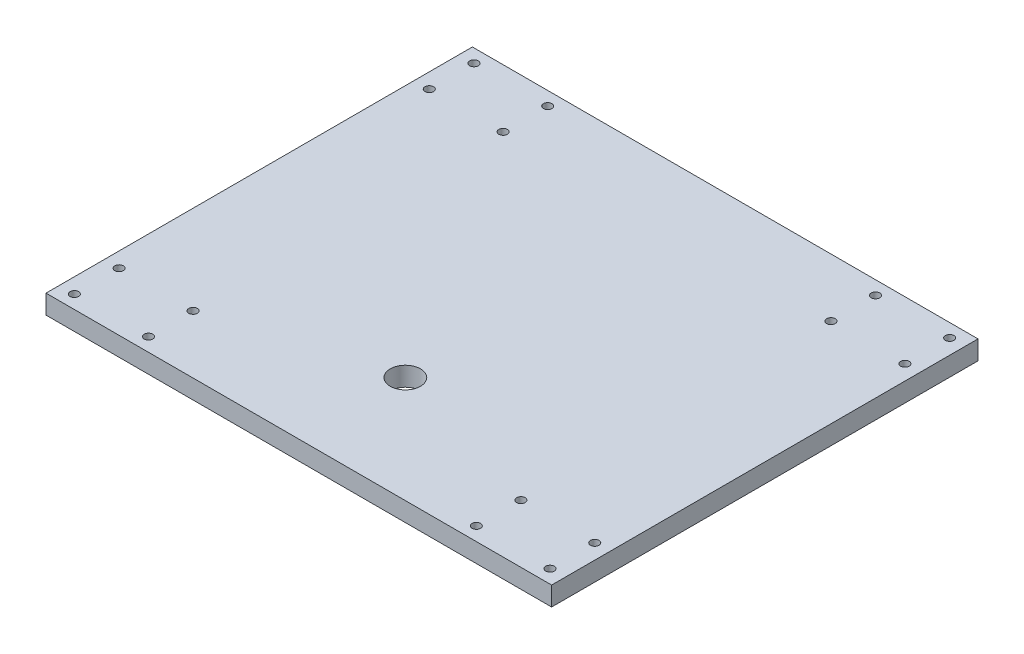
ISO-10303-21;
HEADER;
FILE_DESCRIPTION(('STEP AP214'),'2;1');
FILE_NAME('part.step','',(''),(''),'','','');
FILE_SCHEMA(('AUTOMOTIVE_DESIGN { 1 0 10303 214 1 1 1 1 }'));
ENDSEC;
DATA;
#1=APPLICATION_CONTEXT('core data for automotive mechanical design processes');
#2=APPLICATION_PROTOCOL_DEFINITION('international standard','automotive_design',2000,#1);
#3=PRODUCT_CONTEXT('',#1,'mechanical');
#4=PRODUCT('Part','Part','',(#3));
#5=PRODUCT_RELATED_PRODUCT_CATEGORY('part','',(#4));
#6=PRODUCT_DEFINITION_FORMATION('','',#4);
#7=PRODUCT_DEFINITION_CONTEXT('part definition',#1,'design');
#8=PRODUCT_DEFINITION('design','',#6,#7);
#9=PRODUCT_DEFINITION_SHAPE('','',#8);
#10=(LENGTH_UNIT() NAMED_UNIT(*) SI_UNIT(.MILLI.,.METRE.));
#11=(NAMED_UNIT(*) PLANE_ANGLE_UNIT() SI_UNIT($,.RADIAN.));
#12=(NAMED_UNIT(*) SI_UNIT($,.STERADIAN.) SOLID_ANGLE_UNIT());
#13=UNCERTAINTY_MEASURE_WITH_UNIT(LENGTH_MEASURE(1.E-05),#10,'distance_accuracy_value','');
#14=(GEOMETRIC_REPRESENTATION_CONTEXT(3) GLOBAL_UNCERTAINTY_ASSIGNED_CONTEXT((#13)) GLOBAL_UNIT_ASSIGNED_CONTEXT((#10,
#11,#12)) REPRESENTATION_CONTEXT('',''));
#15=CARTESIAN_POINT('',(0.,0.,0.));
#16=DIRECTION('',(0.,0.,1.));
#17=DIRECTION('',(1.,0.,0.));
#18=AXIS2_PLACEMENT_3D('',#15,#16,#17);
#19=CARTESIAN_POINT('',(0.,19.,0.));
#20=DIRECTION('',(0.,1.,0.));
#21=DIRECTION('',(0.,0.,1.));
#22=AXIS2_PLACEMENT_3D('',#19,#20,#21);
#23=PLANE('',#22);
#24=CARTESIAN_POINT('',(-88.5993514864296,19.,-411.467997078291));
#25=DIRECTION('',(0.,1.,0.));
#26=DIRECTION('',(0.,0.,-1.));
#27=AXIS2_PLACEMENT_3D('',#24,#25,#26);
#28=CIRCLE('',#27,4.25000000000001);
#29=CARTESIAN_POINT('',(-88.5993514864296,19.,-415.717997078291));
#30=VERTEX_POINT('',#29);
#31=EDGE_CURVE('E155',#30,#30,#28,.T.);
#32=ORIENTED_EDGE('',*,*,#31,.F.);
#33=EDGE_LOOP('',(#32));
#34=FACE_BOUND('',#33,.T.);
#35=CARTESIAN_POINT('',(-14.939385216055,19.,-367.08848854777));
#36=DIRECTION('',(0.,1.,0.));
#37=DIRECTION('',(0.,0.,-1.));
#38=AXIS2_PLACEMENT_3D('',#35,#36,#37);
#39=CIRCLE('',#38,4.25000000000001);
#40=CARTESIAN_POINT('',(-14.939385216055,19.,-371.33848854777));
#41=VERTEX_POINT('',#40);
#42=EDGE_CURVE('E148',#41,#41,#39,.T.);
#43=ORIENTED_EDGE('',*,*,#42,.F.);
#44=EDGE_LOOP('',(#43));
#45=FACE_BOUND('',#44,.T.);
#46=CARTESIAN_POINT('',(-88.5993514864296,19.,-367.017997078291));
#47=DIRECTION('',(0.,1.,0.));
#48=DIRECTION('',(0.,0.,-1.));
#49=AXIS2_PLACEMENT_3D('',#46,#47,#48);
#50=CIRCLE('',#49,4.25000000000001);
#51=CARTESIAN_POINT('',(-88.5993514864296,19.,-371.267997078291));
#52=VERTEX_POINT('',#51);
#53=EDGE_CURVE('E167',#52,#52,#50,.T.);
#54=ORIENTED_EDGE('',*,*,#53,.F.);
#55=EDGE_LOOP('',(#54));
#56=FACE_BOUND('',#55,.T.);
#57=CARTESIAN_POINT('',(-415.400648513571,19.,-367.017997078291));
#58=DIRECTION('',(0.,1.,0.));
#59=DIRECTION('',(0.,0.,1.));
#60=AXIS2_PLACEMENT_3D('',#57,#58,#59);
#61=CIRCLE('',#60,4.25000000000001);
#62=CARTESIAN_POINT('',(-415.400648513571,19.,-362.767997078291));
#63=VERTEX_POINT('',#62);
#64=EDGE_CURVE('E160',#63,#63,#61,.T.);
#65=ORIENTED_EDGE('',*,*,#64,.F.);
#66=EDGE_LOOP('',(#65));
#67=FACE_BOUND('',#66,.T.);
#68=CARTESIAN_POINT('',(-14.939385216055,19.,-57.9115114522298));
#69=DIRECTION('',(0.,1.,0.));
#70=DIRECTION('',(0.,0.,1.));
#71=AXIS2_PLACEMENT_3D('',#68,#69,#70);
#72=CIRCLE('',#71,4.25000000000001);
#73=CARTESIAN_POINT('',(-14.939385216055,19.,-53.6615114522297));
#74=VERTEX_POINT('',#73);
#75=EDGE_CURVE('E131',#74,#74,#72,.T.);
#76=ORIENTED_EDGE('',*,*,#75,.F.);
#77=EDGE_LOOP('',(#76));
#78=FACE_BOUND('',#77,.T.);
#79=CARTESIAN_POINT('',(-88.5993514864296,19.,-13.5320029217093));
#80=DIRECTION('',(0.,1.,0.));
#81=DIRECTION('',(0.,0.,1.));
#82=AXIS2_PLACEMENT_3D('',#79,#80,#81);
#83=CIRCLE('',#82,4.25000000000001);
#84=CARTESIAN_POINT('',(-88.5993514864296,19.,-9.28200292170929));
#85=VERTEX_POINT('',#84);
#86=EDGE_CURVE('E124',#85,#85,#83,.T.);
#87=ORIENTED_EDGE('',*,*,#86,.F.);
#88=EDGE_LOOP('',(#87));
#89=FACE_BOUND('',#88,.T.);
#90=CARTESIAN_POINT('',(-14.9396095011054,19.,-411.662960293983));
#91=DIRECTION('',(0.,1.,0.));
#92=DIRECTION('',(0.,0.,-1.));
#93=AXIS2_PLACEMENT_3D('',#90,#91,#92);
#94=CIRCLE('',#93,4.25000000000001);
#95=CARTESIAN_POINT('',(-14.9396095011054,19.,-415.912960293983));
#96=VERTEX_POINT('',#95);
#97=EDGE_CURVE('E143',#96,#96,#94,.T.);
#98=ORIENTED_EDGE('',*,*,#97,.F.);
#99=EDGE_LOOP('',(#98));
#100=FACE_BOUND('',#99,.T.);
#101=CARTESIAN_POINT('',(-14.9396095011054,19.,-13.3370397060172));
#102=DIRECTION('',(0.,1.,0.));
#103=DIRECTION('',(0.,0.,1.));
#104=AXIS2_PLACEMENT_3D('',#101,#102,#103);
#105=CIRCLE('',#104,4.25000000000001);
#106=CARTESIAN_POINT('',(-14.9396095011054,19.,-9.08703970601723));
#107=VERTEX_POINT('',#106);
#108=EDGE_CURVE('E136',#107,#107,#105,.T.);
#109=ORIENTED_EDGE('',*,*,#108,.F.);
#110=EDGE_LOOP('',(#109));
#111=FACE_BOUND('',#110,.T.);
#112=CARTESIAN_POINT('',(-415.40064851357,19.,-13.5320029217093));
#113=DIRECTION('',(0.,1.,0.));
#114=DIRECTION('',(0.,0.,-1.));
#115=AXIS2_PLACEMENT_3D('',#112,#113,#114);
#116=CIRCLE('',#115,4.25000000000001);
#117=CARTESIAN_POINT('',(-415.40064851357,19.,-17.7820029217093));
#118=VERTEX_POINT('',#117);
#119=EDGE_CURVE('E203',#118,#118,#116,.T.);
#120=ORIENTED_EDGE('',*,*,#119,.F.);
#121=EDGE_LOOP('',(#120));
#122=FACE_BOUND('',#121,.T.);
#123=CARTESIAN_POINT('',(-489.060614783945,19.,-57.9115114522296));
#124=DIRECTION('',(0.,1.,0.));
#125=DIRECTION('',(0.,0.,-1.));
#126=AXIS2_PLACEMENT_3D('',#123,#124,#125);
#127=CIRCLE('',#126,4.25000000000006);
#128=CARTESIAN_POINT('',(-489.060614783945,19.,-62.1615114522297));
#129=VERTEX_POINT('',#128);
#130=EDGE_CURVE('E196',#129,#129,#127,.T.);
#131=ORIENTED_EDGE('',*,*,#130,.F.);
#132=EDGE_LOOP('',(#131));
#133=FACE_BOUND('',#132,.T.);
#134=CARTESIAN_POINT('',(-415.40064851357,19.,-57.9820029217093));
#135=DIRECTION('',(0.,1.,0.));
#136=DIRECTION('',(0.,0.,-1.));
#137=AXIS2_PLACEMENT_3D('',#134,#135,#136);
#138=CIRCLE('',#137,4.25000000000001);
#139=CARTESIAN_POINT('',(-415.40064851357,19.,-62.2320029217093));
#140=VERTEX_POINT('',#139);
#141=EDGE_CURVE('E208',#140,#140,#138,.T.);
#142=ORIENTED_EDGE('',*,*,#141,.F.);
#143=EDGE_LOOP('',(#142));
#144=FACE_BOUND('',#143,.T.);
#145=CARTESIAN_POINT('',(-489.060614783945,19.,-367.08848854777));
#146=DIRECTION('',(0.,1.,0.));
#147=DIRECTION('',(0.,0.,1.));
#148=AXIS2_PLACEMENT_3D('',#145,#146,#147);
#149=CIRCLE('',#148,4.25000000000006);
#150=CARTESIAN_POINT('',(-489.060614783945,19.,-362.83848854777));
#151=VERTEX_POINT('',#150);
#152=EDGE_CURVE('E179',#151,#151,#149,.T.);
#153=ORIENTED_EDGE('',*,*,#152,.F.);
#154=EDGE_LOOP('',(#153));
#155=FACE_BOUND('',#154,.T.);
#156=CARTESIAN_POINT('',(-415.400648513571,19.,-411.467997078291));
#157=DIRECTION('',(0.,1.,0.));
#158=DIRECTION('',(0.,0.,1.));
#159=AXIS2_PLACEMENT_3D('',#156,#157,#158);
#160=CIRCLE('',#159,4.25000000000001);
#161=CARTESIAN_POINT('',(-415.400648513571,19.,-407.217997078291));
#162=VERTEX_POINT('',#161);
#163=EDGE_CURVE('E172',#162,#162,#160,.T.);
#164=ORIENTED_EDGE('',*,*,#163,.F.);
#165=EDGE_LOOP('',(#164));
#166=FACE_BOUND('',#165,.T.);
#167=CARTESIAN_POINT('',(-489.060390498895,19.,-411.662960293983));
#168=DIRECTION('',(0.,1.,0.));
#169=DIRECTION('',(0.,0.,1.));
#170=AXIS2_PLACEMENT_3D('',#167,#168,#169);
#171=CIRCLE('',#170,4.25000000000001);
#172=CARTESIAN_POINT('',(-489.060390498895,19.,-407.412960293983));
#173=VERTEX_POINT('',#172);
#174=EDGE_CURVE('E191',#173,#173,#171,.T.);
#175=ORIENTED_EDGE('',*,*,#174,.F.);
#176=EDGE_LOOP('',(#175));
#177=FACE_BOUND('',#176,.T.);
#178=CARTESIAN_POINT('',(-489.060390498895,19.,-13.3370397060171));
#179=DIRECTION('',(0.,1.,0.));
#180=DIRECTION('',(0.,0.,-1.));
#181=AXIS2_PLACEMENT_3D('',#178,#179,#180);
#182=CIRCLE('',#181,4.25000000000001);
#183=CARTESIAN_POINT('',(-489.060390498895,19.,-17.5870397060171));
#184=VERTEX_POINT('',#183);
#185=EDGE_CURVE('E184',#184,#184,#182,.T.);
#186=ORIENTED_EDGE('',*,*,#185,.F.);
#187=EDGE_LOOP('',(#186));
#188=FACE_BOUND('',#187,.T.);
#189=CARTESIAN_POINT('',(-88.5993514864296,19.,-57.9820029217093));
#190=DIRECTION('',(0.,1.,0.));
#191=DIRECTION('',(0.,0.,1.));
#192=AXIS2_PLACEMENT_3D('',#189,#190,#191);
#193=CIRCLE('',#192,4.25000000000001);
#194=CARTESIAN_POINT('',(-88.5993514864296,19.,-53.7320029217093));
#195=VERTEX_POINT('',#194);
#196=EDGE_CURVE('E118',#195,#195,#193,.T.);
#197=ORIENTED_EDGE('',*,*,#196,.F.);
#198=EDGE_LOOP('',(#197));
#199=FACE_BOUND('',#198,.T.);
#200=DIRECTION('',(0.,0.,1.));
#201=VECTOR('',#200,1.);
#202=CARTESIAN_POINT('',(-504.,19.,-425.));
#203=LINE('',#202,#201);
#204=CARTESIAN_POINT('',(-504.,19.,-425.));
#205=VERTEX_POINT('',#204);
#206=CARTESIAN_POINT('',(-504.,19.,0.));
#207=VERTEX_POINT('',#206);
#208=EDGE_CURVE('E85',#205,#207,#203,.T.);
#209=ORIENTED_EDGE('',*,*,#208,.T.);
#210=DIRECTION('',(1.,0.,0.));
#211=VECTOR('',#210,1.);
#212=CARTESIAN_POINT('',(-504.,19.,0.));
#213=LINE('',#212,#211);
#214=CARTESIAN_POINT('',(0.,19.,0.));
#215=VERTEX_POINT('',#214);
#216=EDGE_CURVE('E80',#207,#215,#213,.T.);
#217=ORIENTED_EDGE('',*,*,#216,.T.);
#218=DIRECTION('',(0.,0.,-1.));
#219=VECTOR('',#218,1.);
#220=CARTESIAN_POINT('',(0.,19.,-425.));
#221=LINE('',#220,#219);
#222=CARTESIAN_POINT('',(0.,19.,-425.));
#223=VERTEX_POINT('',#222);
#224=EDGE_CURVE('E83',#215,#223,#221,.T.);
#225=ORIENTED_EDGE('',*,*,#224,.T.);
#226=DIRECTION('',(-1.,0.,0.));
#227=VECTOR('',#226,1.);
#228=CARTESIAN_POINT('',(-504.,19.,-425.));
#229=LINE('',#228,#227);
#230=EDGE_CURVE('E50',#223,#205,#229,.T.);
#231=ORIENTED_EDGE('',*,*,#230,.T.);
#232=EDGE_LOOP('',(#209,#217,#225,#231));
#233=FACE_BOUND('',#232,.T.);
#234=CARTESIAN_POINT('',(-252.,19.,-106.2));
#235=DIRECTION('',(0.,1.,0.));
#236=DIRECTION('',(0.,0.,1.));
#237=AXIS2_PLACEMENT_3D('',#234,#235,#236);
#238=CIRCLE('',#237,15.08125);
#239=CARTESIAN_POINT('',(-252.,19.,-91.11875));
#240=VERTEX_POINT('',#239);
#241=EDGE_CURVE('E100',#240,#240,#238,.T.);
#242=ORIENTED_EDGE('',*,*,#241,.F.);
#243=EDGE_LOOP('',(#242));
#244=FACE_BOUND('',#243,.T.);
#245=ADVANCED_FACE('F33',(#34,#45,#56,#67,#78,#89,#100,#111,#122,#133,#144,#155,#166,#177,#188,
#199,#233,#244),#23,.T.);
#246=CARTESIAN_POINT('',(0.,0.,0.));
#247=DIRECTION('',(0.,1.,0.));
#248=DIRECTION('',(0.,0.,1.));
#249=AXIS2_PLACEMENT_3D('',#246,#247,#248);
#250=PLANE('',#249);
#251=CARTESIAN_POINT('',(-88.5993514864296,0.,-411.467997078291));
#252=DIRECTION('',(0.,1.,0.));
#253=DIRECTION('',(0.,0.,-1.));
#254=AXIS2_PLACEMENT_3D('',#251,#252,#253);
#255=CIRCLE('',#254,4.25000000000001);
#256=CARTESIAN_POINT('',(-88.5993514864296,0.,-415.717997078291));
#257=VERTEX_POINT('',#256);
#258=EDGE_CURVE('E140',#257,#257,#255,.T.);
#259=ORIENTED_EDGE('',*,*,#258,.T.);
#260=EDGE_LOOP('',(#259));
#261=FACE_BOUND('',#260,.T.);
#262=CARTESIAN_POINT('',(-14.939385216055,0.,-367.08848854777));
#263=DIRECTION('',(0.,1.,0.));
#264=DIRECTION('',(0.,0.,-1.));
#265=AXIS2_PLACEMENT_3D('',#262,#263,#264);
#266=CIRCLE('',#265,4.25000000000001);
#267=CARTESIAN_POINT('',(-14.939385216055,0.,-371.33848854777));
#268=VERTEX_POINT('',#267);
#269=EDGE_CURVE('E151',#268,#268,#266,.T.);
#270=ORIENTED_EDGE('',*,*,#269,.T.);
#271=EDGE_LOOP('',(#270));
#272=FACE_BOUND('',#271,.T.);
#273=CARTESIAN_POINT('',(-88.5993514864296,0.,-367.017997078291));
#274=DIRECTION('',(0.,1.,0.));
#275=DIRECTION('',(0.,0.,-1.));
#276=AXIS2_PLACEMENT_3D('',#273,#274,#275);
#277=CIRCLE('',#276,4.25000000000001);
#278=CARTESIAN_POINT('',(-88.5993514864296,0.,-371.267997078291));
#279=VERTEX_POINT('',#278);
#280=EDGE_CURVE('E152',#279,#279,#277,.T.);
#281=ORIENTED_EDGE('',*,*,#280,.T.);
#282=EDGE_LOOP('',(#281));
#283=FACE_BOUND('',#282,.T.);
#284=CARTESIAN_POINT('',(-415.400648513571,0.,-367.017997078291));
#285=DIRECTION('',(0.,1.,0.));
#286=DIRECTION('',(0.,0.,1.));
#287=AXIS2_PLACEMENT_3D('',#284,#285,#286);
#288=CIRCLE('',#287,4.25000000000001);
#289=CARTESIAN_POINT('',(-415.400648513571,0.,-362.767997078291));
#290=VERTEX_POINT('',#289);
#291=EDGE_CURVE('E163',#290,#290,#288,.T.);
#292=ORIENTED_EDGE('',*,*,#291,.T.);
#293=EDGE_LOOP('',(#292));
#294=FACE_BOUND('',#293,.T.);
#295=CARTESIAN_POINT('',(-14.939385216055,0.,-57.9115114522298));
#296=DIRECTION('',(0.,1.,0.));
#297=DIRECTION('',(0.,0.,1.));
#298=AXIS2_PLACEMENT_3D('',#295,#296,#297);
#299=CIRCLE('',#298,4.25000000000001);
#300=CARTESIAN_POINT('',(-14.939385216055,0.,-53.6615114522297));
#301=VERTEX_POINT('',#300);
#302=EDGE_CURVE('E121',#301,#301,#299,.T.);
#303=ORIENTED_EDGE('',*,*,#302,.T.);
#304=EDGE_LOOP('',(#303));
#305=FACE_BOUND('',#304,.T.);
#306=CARTESIAN_POINT('',(-88.5993514864296,0.,-13.5320029217093));
#307=DIRECTION('',(0.,1.,0.));
#308=DIRECTION('',(0.,0.,1.));
#309=AXIS2_PLACEMENT_3D('',#306,#307,#308);
#310=CIRCLE('',#309,4.25000000000001);
#311=CARTESIAN_POINT('',(-88.5993514864296,0.,-9.28200292170929));
#312=VERTEX_POINT('',#311);
#313=EDGE_CURVE('E127',#312,#312,#310,.T.);
#314=ORIENTED_EDGE('',*,*,#313,.T.);
#315=EDGE_LOOP('',(#314));
#316=FACE_BOUND('',#315,.T.);
#317=CARTESIAN_POINT('',(-14.9396095011054,0.,-411.662960293983));
#318=DIRECTION('',(0.,1.,0.));
#319=DIRECTION('',(0.,0.,-1.));
#320=AXIS2_PLACEMENT_3D('',#317,#318,#319);
#321=CIRCLE('',#320,4.25000000000001);
#322=CARTESIAN_POINT('',(-14.9396095011054,0.,-415.912960293983));
#323=VERTEX_POINT('',#322);
#324=EDGE_CURVE('E128',#323,#323,#321,.T.);
#325=ORIENTED_EDGE('',*,*,#324,.T.);
#326=EDGE_LOOP('',(#325));
#327=FACE_BOUND('',#326,.T.);
#328=CARTESIAN_POINT('',(-14.9396095011054,0.,-13.3370397060172));
#329=DIRECTION('',(0.,1.,0.));
#330=DIRECTION('',(0.,0.,1.));
#331=AXIS2_PLACEMENT_3D('',#328,#329,#330);
#332=CIRCLE('',#331,4.25000000000001);
#333=CARTESIAN_POINT('',(-14.9396095011054,0.,-9.08703970601723));
#334=VERTEX_POINT('',#333);
#335=EDGE_CURVE('E139',#334,#334,#332,.T.);
#336=ORIENTED_EDGE('',*,*,#335,.T.);
#337=EDGE_LOOP('',(#336));
#338=FACE_BOUND('',#337,.T.);
#339=CARTESIAN_POINT('',(-415.40064851357,0.,-13.5320029217093));
#340=DIRECTION('',(0.,1.,0.));
#341=DIRECTION('',(0.,0.,-1.));
#342=AXIS2_PLACEMENT_3D('',#339,#340,#341);
#343=CIRCLE('',#342,4.25000000000001);
#344=CARTESIAN_POINT('',(-415.40064851357,0.,-17.7820029217093));
#345=VERTEX_POINT('',#344);
#346=EDGE_CURVE('E188',#345,#345,#343,.T.);
#347=ORIENTED_EDGE('',*,*,#346,.T.);
#348=EDGE_LOOP('',(#347));
#349=FACE_BOUND('',#348,.T.);
#350=CARTESIAN_POINT('',(-489.060614783945,0.,-57.9115114522296));
#351=DIRECTION('',(0.,1.,0.));
#352=DIRECTION('',(0.,0.,-1.));
#353=AXIS2_PLACEMENT_3D('',#350,#351,#352);
#354=CIRCLE('',#353,4.25000000000006);
#355=CARTESIAN_POINT('',(-489.060614783945,0.,-62.1615114522297));
#356=VERTEX_POINT('',#355);
#357=EDGE_CURVE('E199',#356,#356,#354,.T.);
#358=ORIENTED_EDGE('',*,*,#357,.T.);
#359=EDGE_LOOP('',(#358));
#360=FACE_BOUND('',#359,.T.);
#361=CARTESIAN_POINT('',(-415.40064851357,0.,-57.9820029217093));
#362=DIRECTION('',(0.,1.,0.));
#363=DIRECTION('',(0.,0.,-1.));
#364=AXIS2_PLACEMENT_3D('',#361,#362,#363);
#365=CIRCLE('',#364,4.25000000000001);
#366=CARTESIAN_POINT('',(-415.40064851357,0.,-62.2320029217093));
#367=VERTEX_POINT('',#366);
#368=EDGE_CURVE('E200',#367,#367,#365,.T.);
#369=ORIENTED_EDGE('',*,*,#368,.T.);
#370=EDGE_LOOP('',(#369));
#371=FACE_BOUND('',#370,.T.);
#372=CARTESIAN_POINT('',(-489.060614783945,0.,-367.08848854777));
#373=DIRECTION('',(0.,1.,0.));
#374=DIRECTION('',(0.,0.,1.));
#375=AXIS2_PLACEMENT_3D('',#372,#373,#374);
#376=CIRCLE('',#375,4.25000000000006);
#377=CARTESIAN_POINT('',(-489.060614783945,0.,-362.83848854777));
#378=VERTEX_POINT('',#377);
#379=EDGE_CURVE('E164',#378,#378,#376,.T.);
#380=ORIENTED_EDGE('',*,*,#379,.T.);
#381=EDGE_LOOP('',(#380));
#382=FACE_BOUND('',#381,.T.);
#383=CARTESIAN_POINT('',(-415.400648513571,0.,-411.467997078291));
#384=DIRECTION('',(0.,1.,0.));
#385=DIRECTION('',(0.,0.,1.));
#386=AXIS2_PLACEMENT_3D('',#383,#384,#385);
#387=CIRCLE('',#386,4.25000000000001);
#388=CARTESIAN_POINT('',(-415.400648513571,0.,-407.217997078291));
#389=VERTEX_POINT('',#388);
#390=EDGE_CURVE('E175',#389,#389,#387,.T.);
#391=ORIENTED_EDGE('',*,*,#390,.T.);
#392=EDGE_LOOP('',(#391));
#393=FACE_BOUND('',#392,.T.);
#394=CARTESIAN_POINT('',(-489.060390498895,0.,-411.662960293983));
#395=DIRECTION('',(0.,1.,0.));
#396=DIRECTION('',(0.,0.,1.));
#397=AXIS2_PLACEMENT_3D('',#394,#395,#396);
#398=CIRCLE('',#397,4.25000000000001);
#399=CARTESIAN_POINT('',(-489.060390498895,0.,-407.412960293983));
#400=VERTEX_POINT('',#399);
#401=EDGE_CURVE('E176',#400,#400,#398,.T.);
#402=ORIENTED_EDGE('',*,*,#401,.T.);
#403=EDGE_LOOP('',(#402));
#404=FACE_BOUND('',#403,.T.);
#405=CARTESIAN_POINT('',(-489.060390498895,0.,-13.3370397060171));
#406=DIRECTION('',(0.,1.,0.));
#407=DIRECTION('',(0.,0.,-1.));
#408=AXIS2_PLACEMENT_3D('',#405,#406,#407);
#409=CIRCLE('',#408,4.25000000000001);
#410=CARTESIAN_POINT('',(-489.060390498895,0.,-17.5870397060171));
#411=VERTEX_POINT('',#410);
#412=EDGE_CURVE('E187',#411,#411,#409,.T.);
#413=ORIENTED_EDGE('',*,*,#412,.T.);
#414=EDGE_LOOP('',(#413));
#415=FACE_BOUND('',#414,.T.);
#416=CARTESIAN_POINT('',(-88.5993514864296,0.,-57.9820029217093));
#417=DIRECTION('',(0.,1.,0.));
#418=DIRECTION('',(0.,0.,1.));
#419=AXIS2_PLACEMENT_3D('',#416,#417,#418);
#420=CIRCLE('',#419,4.25000000000001);
#421=CARTESIAN_POINT('',(-88.5993514864296,0.,-53.7320029217093));
#422=VERTEX_POINT('',#421);
#423=EDGE_CURVE('E115',#422,#422,#420,.T.);
#424=ORIENTED_EDGE('',*,*,#423,.T.);
#425=EDGE_LOOP('',(#424));
#426=FACE_BOUND('',#425,.T.);
#427=DIRECTION('',(0.,0.,1.));
#428=VECTOR('',#427,1.);
#429=CARTESIAN_POINT('',(-504.,0.,-425.));
#430=LINE('',#429,#428);
#431=CARTESIAN_POINT('',(-504.,0.,-425.));
#432=VERTEX_POINT('',#431);
#433=CARTESIAN_POINT('',(-504.,0.,0.));
#434=VERTEX_POINT('',#433);
#435=EDGE_CURVE('E97',#432,#434,#430,.T.);
#436=ORIENTED_EDGE('',*,*,#435,.F.);
#437=DIRECTION('',(-1.,0.,0.));
#438=VECTOR('',#437,1.);
#439=CARTESIAN_POINT('',(-504.,0.,-425.));
#440=LINE('',#439,#438);
#441=CARTESIAN_POINT('',(0.,0.,-425.));
#442=VERTEX_POINT('',#441);
#443=EDGE_CURVE('E73',#442,#432,#440,.T.);
#444=ORIENTED_EDGE('',*,*,#443,.F.);
#445=DIRECTION('',(0.,0.,-1.));
#446=VECTOR('',#445,1.);
#447=CARTESIAN_POINT('',(0.,0.,-425.));
#448=LINE('',#447,#446);
#449=CARTESIAN_POINT('',(0.,0.,0.));
#450=VERTEX_POINT('',#449);
#451=EDGE_CURVE('E67',#450,#442,#448,.T.);
#452=ORIENTED_EDGE('',*,*,#451,.F.);
#453=DIRECTION('',(1.,0.,0.));
#454=VECTOR('',#453,1.);
#455=CARTESIAN_POINT('',(-504.,0.,0.));
#456=LINE('',#455,#454);
#457=EDGE_CURVE('E89',#434,#450,#456,.T.);
#458=ORIENTED_EDGE('',*,*,#457,.F.);
#459=EDGE_LOOP('',(#436,#444,#452,#458));
#460=FACE_BOUND('',#459,.T.);
#461=CARTESIAN_POINT('',(-252.,0.,-106.2));
#462=DIRECTION('',(0.,1.,0.));
#463=DIRECTION('',(0.,0.,1.));
#464=AXIS2_PLACEMENT_3D('',#461,#462,#463);
#465=CIRCLE('',#464,15.08125);
#466=CARTESIAN_POINT('',(-252.,0.,-91.11875));
#467=VERTEX_POINT('',#466);
#468=EDGE_CURVE('E112',#467,#467,#465,.T.);
#469=ORIENTED_EDGE('',*,*,#468,.T.);
#470=EDGE_LOOP('',(#469));
#471=FACE_BOUND('',#470,.T.);
#472=ADVANCED_FACE('F108',(#261,#272,#283,#294,#305,#316,#327,#338,#349,#360,#371,#382,#393,
#404,#415,#426,#460,#471),#250,.F.);
#473=CARTESIAN_POINT('',(-504.,19.,-425.));
#474=DIRECTION('',(1.,0.,0.));
#475=DIRECTION('',(0.,0.,-1.));
#476=AXIS2_PLACEMENT_3D('',#473,#474,#475);
#477=PLANE('',#476);
#478=ORIENTED_EDGE('',*,*,#435,.T.);
#479=DIRECTION('',(0.,-1.,0.));
#480=VECTOR('',#479,1.);
#481=CARTESIAN_POINT('',(-504.,19.,0.));
#482=LINE('',#481,#480);
#483=EDGE_CURVE('E11',#207,#434,#482,.T.);
#484=ORIENTED_EDGE('',*,*,#483,.F.);
#485=ORIENTED_EDGE('',*,*,#208,.F.);
#486=DIRECTION('',(0.,-1.,0.));
#487=VECTOR('',#486,1.);
#488=CARTESIAN_POINT('',(-504.,19.,-425.));
#489=LINE('',#488,#487);
#490=EDGE_CURVE('E93',#205,#432,#489,.T.);
#491=ORIENTED_EDGE('',*,*,#490,.T.);
#492=EDGE_LOOP('',(#478,#484,#485,#491));
#493=FACE_BOUND('',#492,.T.);
#494=ADVANCED_FACE('F35',(#493),#477,.F.);
#495=CARTESIAN_POINT('',(-504.,19.,0.));
#496=DIRECTION('',(0.,0.,-1.));
#497=DIRECTION('',(-1.,0.,0.));
#498=AXIS2_PLACEMENT_3D('',#495,#496,#497);
#499=PLANE('',#498);
#500=ORIENTED_EDGE('',*,*,#457,.T.);
#501=DIRECTION('',(0.,-1.,0.));
#502=VECTOR('',#501,1.);
#503=CARTESIAN_POINT('',(0.,19.,0.));
#504=LINE('',#503,#502);
#505=EDGE_CURVE('E42',#215,#450,#504,.T.);
#506=ORIENTED_EDGE('',*,*,#505,.F.);
#507=ORIENTED_EDGE('',*,*,#216,.F.);
#508=ORIENTED_EDGE('',*,*,#483,.T.);
#509=EDGE_LOOP('',(#500,#506,#507,#508));
#510=FACE_BOUND('',#509,.T.);
#511=ADVANCED_FACE('F88',(#510),#499,.F.);
#512=CARTESIAN_POINT('',(0.,19.,-425.));
#513=DIRECTION('',(-1.,0.,0.));
#514=DIRECTION('',(0.,0.,1.));
#515=AXIS2_PLACEMENT_3D('',#512,#513,#514);
#516=PLANE('',#515);
#517=ORIENTED_EDGE('',*,*,#451,.T.);
#518=DIRECTION('',(0.,-1.,0.));
#519=VECTOR('',#518,1.);
#520=CARTESIAN_POINT('',(0.,19.,-425.));
#521=LINE('',#520,#519);
#522=EDGE_CURVE('E90',#223,#442,#521,.T.);
#523=ORIENTED_EDGE('',*,*,#522,.F.);
#524=ORIENTED_EDGE('',*,*,#224,.F.);
#525=ORIENTED_EDGE('',*,*,#505,.T.);
#526=EDGE_LOOP('',(#517,#523,#524,#525));
#527=FACE_BOUND('',#526,.T.);
#528=ADVANCED_FACE('F91',(#527),#516,.F.);
#529=CARTESIAN_POINT('',(-504.,19.,-425.));
#530=DIRECTION('',(0.,0.,1.));
#531=DIRECTION('',(1.,0.,0.));
#532=AXIS2_PLACEMENT_3D('',#529,#530,#531);
#533=PLANE('',#532);
#534=ORIENTED_EDGE('',*,*,#443,.T.);
#535=ORIENTED_EDGE('',*,*,#490,.F.);
#536=ORIENTED_EDGE('',*,*,#230,.F.);
#537=ORIENTED_EDGE('',*,*,#522,.T.);
#538=EDGE_LOOP('',(#534,#535,#536,#537));
#539=FACE_BOUND('',#538,.T.);
#540=ADVANCED_FACE('F105',(#539),#533,.F.);
#541=CARTESIAN_POINT('',(-252.,19.,-106.2));
#542=DIRECTION('',(0.,-1.,0.));
#543=DIRECTION('',(0.,0.,-1.));
#544=AXIS2_PLACEMENT_3D('',#541,#542,#543);
#545=CYLINDRICAL_SURFACE('',#544,15.08125);
#546=ORIENTED_EDGE('',*,*,#241,.T.);
#547=EDGE_LOOP('',(#546));
#548=FACE_BOUND('',#547,.T.);
#549=ORIENTED_EDGE('',*,*,#468,.F.);
#550=EDGE_LOOP('',(#549));
#551=FACE_BOUND('',#550,.T.);
#552=ADVANCED_FACE('F241',(#548,#551),#545,.F.);
#553=CARTESIAN_POINT('',(-88.5993514864296,0.,-57.9820029217093));
#554=DIRECTION('',(0.,1.,0.));
#555=DIRECTION('',(0.,0.,1.));
#556=AXIS2_PLACEMENT_3D('',#553,#554,#555);
#557=CYLINDRICAL_SURFACE('',#556,4.25000000000001);
#558=ORIENTED_EDGE('',*,*,#423,.F.);
#559=EDGE_LOOP('',(#558));
#560=FACE_BOUND('',#559,.T.);
#561=ORIENTED_EDGE('',*,*,#196,.T.);
#562=EDGE_LOOP('',(#561));
#563=FACE_BOUND('',#562,.T.);
#564=ADVANCED_FACE('F238',(#560,#563),#557,.F.);
#565=CARTESIAN_POINT('',(-489.060390498895,0.,-13.3370397060171));
#566=DIRECTION('',(0.,1.,0.));
#567=DIRECTION('',(0.,0.,1.));
#568=AXIS2_PLACEMENT_3D('',#565,#566,#567);
#569=CYLINDRICAL_SURFACE('',#568,4.25000000000001);
#570=ORIENTED_EDGE('',*,*,#412,.F.);
#571=EDGE_LOOP('',(#570));
#572=FACE_BOUND('',#571,.T.);
#573=ORIENTED_EDGE('',*,*,#185,.T.);
#574=EDGE_LOOP('',(#573));
#575=FACE_BOUND('',#574,.T.);
#576=ADVANCED_FACE('F240',(#572,#575),#569,.F.);
#577=CARTESIAN_POINT('',(-489.060390498895,0.,-411.662960293983));
#578=DIRECTION('',(0.,1.,0.));
#579=DIRECTION('',(0.,0.,1.));
#580=AXIS2_PLACEMENT_3D('',#577,#578,#579);
#581=CYLINDRICAL_SURFACE('',#580,4.25000000000001);
#582=ORIENTED_EDGE('',*,*,#401,.F.);
#583=EDGE_LOOP('',(#582));
#584=FACE_BOUND('',#583,.T.);
#585=ORIENTED_EDGE('',*,*,#174,.T.);
#586=EDGE_LOOP('',(#585));
#587=FACE_BOUND('',#586,.T.);
#588=ADVANCED_FACE('F248',(#584,#587),#581,.F.);
#589=CARTESIAN_POINT('',(-415.400648513571,0.,-411.467997078291));
#590=DIRECTION('',(0.,1.,0.));
#591=DIRECTION('',(0.,0.,1.));
#592=AXIS2_PLACEMENT_3D('',#589,#590,#591);
#593=CYLINDRICAL_SURFACE('',#592,4.25000000000001);
#594=ORIENTED_EDGE('',*,*,#390,.F.);
#595=EDGE_LOOP('',(#594));
#596=FACE_BOUND('',#595,.T.);
#597=ORIENTED_EDGE('',*,*,#163,.T.);
#598=EDGE_LOOP('',(#597));
#599=FACE_BOUND('',#598,.T.);
#600=ADVANCED_FACE('F323',(#596,#599),#593,.F.);
#601=CARTESIAN_POINT('',(-489.060614783945,0.,-367.08848854777));
#602=DIRECTION('',(0.,1.,0.));
#603=DIRECTION('',(0.,0.,1.));
#604=AXIS2_PLACEMENT_3D('',#601,#602,#603);
#605=CYLINDRICAL_SURFACE('',#604,4.25000000000006);
#606=ORIENTED_EDGE('',*,*,#379,.F.);
#607=EDGE_LOOP('',(#606));
#608=FACE_BOUND('',#607,.T.);
#609=ORIENTED_EDGE('',*,*,#152,.T.);
#610=EDGE_LOOP('',(#609));
#611=FACE_BOUND('',#610,.T.);
#612=ADVANCED_FACE('F220',(#608,#611),#605,.F.);
#613=CARTESIAN_POINT('',(-415.40064851357,0.,-57.9820029217093));
#614=DIRECTION('',(0.,1.,0.));
#615=DIRECTION('',(0.,0.,1.));
#616=AXIS2_PLACEMENT_3D('',#613,#614,#615);
#617=CYLINDRICAL_SURFACE('',#616,4.25000000000001);
#618=ORIENTED_EDGE('',*,*,#368,.F.);
#619=EDGE_LOOP('',(#618));
#620=FACE_BOUND('',#619,.T.);
#621=ORIENTED_EDGE('',*,*,#141,.T.);
#622=EDGE_LOOP('',(#621));
#623=FACE_BOUND('',#622,.T.);
#624=ADVANCED_FACE('F216',(#620,#623),#617,.F.);
#625=CARTESIAN_POINT('',(-489.060614783945,0.,-57.9115114522296));
#626=DIRECTION('',(0.,1.,0.));
#627=DIRECTION('',(0.,0.,1.));
#628=AXIS2_PLACEMENT_3D('',#625,#626,#627);
#629=CYLINDRICAL_SURFACE('',#628,4.25000000000006);
#630=ORIENTED_EDGE('',*,*,#357,.F.);
#631=EDGE_LOOP('',(#630));
#632=FACE_BOUND('',#631,.T.);
#633=ORIENTED_EDGE('',*,*,#130,.T.);
#634=EDGE_LOOP('',(#633));
#635=FACE_BOUND('',#634,.T.);
#636=ADVANCED_FACE('F219',(#632,#635),#629,.F.);
#637=CARTESIAN_POINT('',(-415.40064851357,0.,-13.5320029217093));
#638=DIRECTION('',(0.,1.,0.));
#639=DIRECTION('',(0.,0.,1.));
#640=AXIS2_PLACEMENT_3D('',#637,#638,#639);
#641=CYLINDRICAL_SURFACE('',#640,4.25000000000001);
#642=ORIENTED_EDGE('',*,*,#346,.F.);
#643=EDGE_LOOP('',(#642));
#644=FACE_BOUND('',#643,.T.);
#645=ORIENTED_EDGE('',*,*,#119,.T.);
#646=EDGE_LOOP('',(#645));
#647=FACE_BOUND('',#646,.T.);
#648=ADVANCED_FACE('F353',(#644,#647),#641,.F.);
#649=CARTESIAN_POINT('',(-14.9396095011054,0.,-13.3370397060172));
#650=DIRECTION('',(0.,1.,0.));
#651=DIRECTION('',(0.,0.,1.));
#652=AXIS2_PLACEMENT_3D('',#649,#650,#651);
#653=CYLINDRICAL_SURFACE('',#652,4.25000000000001);
#654=ORIENTED_EDGE('',*,*,#335,.F.);
#655=EDGE_LOOP('',(#654));
#656=FACE_BOUND('',#655,.T.);
#657=ORIENTED_EDGE('',*,*,#108,.T.);
#658=EDGE_LOOP('',(#657));
#659=FACE_BOUND('',#658,.T.);
#660=ADVANCED_FACE('F362',(#656,#659),#653,.F.);
#661=CARTESIAN_POINT('',(-14.9396095011054,0.,-411.662960293983));
#662=DIRECTION('',(0.,1.,0.));
#663=DIRECTION('',(0.,0.,1.));
#664=AXIS2_PLACEMENT_3D('',#661,#662,#663);
#665=CYLINDRICAL_SURFACE('',#664,4.25000000000001);
#666=ORIENTED_EDGE('',*,*,#324,.F.);
#667=EDGE_LOOP('',(#666));
#668=FACE_BOUND('',#667,.T.);
#669=ORIENTED_EDGE('',*,*,#97,.T.);
#670=EDGE_LOOP('',(#669));
#671=FACE_BOUND('',#670,.T.);
#672=ADVANCED_FACE('F371',(#668,#671),#665,.F.);
#673=CARTESIAN_POINT('',(-88.5993514864296,0.,-13.5320029217093));
#674=DIRECTION('',(0.,1.,0.));
#675=DIRECTION('',(0.,0.,1.));
#676=AXIS2_PLACEMENT_3D('',#673,#674,#675);
#677=CYLINDRICAL_SURFACE('',#676,4.25000000000001);
#678=ORIENTED_EDGE('',*,*,#313,.F.);
#679=EDGE_LOOP('',(#678));
#680=FACE_BOUND('',#679,.T.);
#681=ORIENTED_EDGE('',*,*,#86,.T.);
#682=EDGE_LOOP('',(#681));
#683=FACE_BOUND('',#682,.T.);
#684=ADVANCED_FACE('F255',(#680,#683),#677,.F.);
#685=CARTESIAN_POINT('',(-14.939385216055,0.,-57.9115114522298));
#686=DIRECTION('',(0.,1.,0.));
#687=DIRECTION('',(0.,0.,1.));
#688=AXIS2_PLACEMENT_3D('',#685,#686,#687);
#689=CYLINDRICAL_SURFACE('',#688,4.25000000000001);
#690=ORIENTED_EDGE('',*,*,#302,.F.);
#691=EDGE_LOOP('',(#690));
#692=FACE_BOUND('',#691,.T.);
#693=ORIENTED_EDGE('',*,*,#75,.T.);
#694=EDGE_LOOP('',(#693));
#695=FACE_BOUND('',#694,.T.);
#696=ADVANCED_FACE('F388',(#692,#695),#689,.F.);
#697=CARTESIAN_POINT('',(-415.400648513571,0.,-367.017997078291));
#698=DIRECTION('',(0.,1.,0.));
#699=DIRECTION('',(0.,0.,1.));
#700=AXIS2_PLACEMENT_3D('',#697,#698,#699);
#701=CYLINDRICAL_SURFACE('',#700,4.25000000000001);
#702=ORIENTED_EDGE('',*,*,#291,.F.);
#703=EDGE_LOOP('',(#702));
#704=FACE_BOUND('',#703,.T.);
#705=ORIENTED_EDGE('',*,*,#64,.T.);
#706=EDGE_LOOP('',(#705));
#707=FACE_BOUND('',#706,.T.);
#708=ADVANCED_FACE('F396',(#704,#707),#701,.F.);
#709=CARTESIAN_POINT('',(-88.5993514864296,0.,-367.017997078291));
#710=DIRECTION('',(0.,1.,0.));
#711=DIRECTION('',(0.,0.,1.));
#712=AXIS2_PLACEMENT_3D('',#709,#710,#711);
#713=CYLINDRICAL_SURFACE('',#712,4.25000000000001);
#714=ORIENTED_EDGE('',*,*,#280,.F.);
#715=EDGE_LOOP('',(#714));
#716=FACE_BOUND('',#715,.T.);
#717=ORIENTED_EDGE('',*,*,#53,.T.);
#718=EDGE_LOOP('',(#717));
#719=FACE_BOUND('',#718,.T.);
#720=ADVANCED_FACE('F404',(#716,#719),#713,.F.);
#721=CARTESIAN_POINT('',(-14.939385216055,0.,-367.08848854777));
#722=DIRECTION('',(0.,1.,0.));
#723=DIRECTION('',(0.,0.,1.));
#724=AXIS2_PLACEMENT_3D('',#721,#722,#723);
#725=CYLINDRICAL_SURFACE('',#724,4.25000000000001);
#726=ORIENTED_EDGE('',*,*,#269,.F.);
#727=EDGE_LOOP('',(#726));
#728=FACE_BOUND('',#727,.T.);
#729=ORIENTED_EDGE('',*,*,#42,.T.);
#730=EDGE_LOOP('',(#729));
#731=FACE_BOUND('',#730,.T.);
#732=ADVANCED_FACE('F413',(#728,#731),#725,.F.);
#733=CARTESIAN_POINT('',(-88.5993514864296,0.,-411.467997078291));
#734=DIRECTION('',(0.,1.,0.));
#735=DIRECTION('',(0.,0.,1.));
#736=AXIS2_PLACEMENT_3D('',#733,#734,#735);
#737=CYLINDRICAL_SURFACE('',#736,4.25000000000001);
#738=ORIENTED_EDGE('',*,*,#258,.F.);
#739=EDGE_LOOP('',(#738));
#740=FACE_BOUND('',#739,.T.);
#741=ORIENTED_EDGE('',*,*,#31,.T.);
#742=EDGE_LOOP('',(#741));
#743=FACE_BOUND('',#742,.T.);
#744=ADVANCED_FACE('F422',(#740,#743),#737,.F.);
#745=CLOSED_SHELL('',(#245,#472,#494,#511,#528,#540,#552,#564,#576,#588,#600,#612,#624,#636,
#648,#660,#672,#684,#696,#708,#720,#732,#744));
#746=MANIFOLD_SOLID_BREP('B2',#745);
#747=ADVANCED_BREP_SHAPE_REPRESENTATION('',(#18,#746),#14);
#748=SHAPE_DEFINITION_REPRESENTATION(#9,#747);
ENDSEC;
END-ISO-10303-21;
